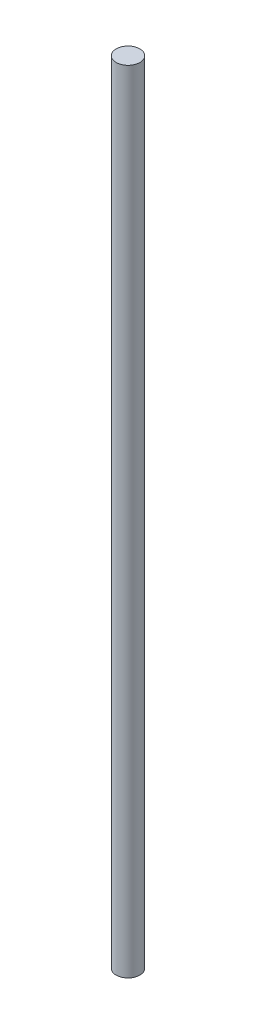
ISO-10303-21;
HEADER;
FILE_DESCRIPTION(('STEP AP214'),'2;1');
FILE_NAME('part.step','',(''),(''),'','','');
FILE_SCHEMA(('AUTOMOTIVE_DESIGN { 1 0 10303 214 1 1 1 1 }'));
ENDSEC;
DATA;
#1=APPLICATION_CONTEXT('core data for automotive mechanical design processes');
#2=APPLICATION_PROTOCOL_DEFINITION('international standard','automotive_design',2000,#1);
#3=PRODUCT_CONTEXT('',#1,'mechanical');
#4=PRODUCT('Part','Part','',(#3));
#5=PRODUCT_RELATED_PRODUCT_CATEGORY('part','',(#4));
#6=PRODUCT_DEFINITION_FORMATION('','',#4);
#7=PRODUCT_DEFINITION_CONTEXT('part definition',#1,'design');
#8=PRODUCT_DEFINITION('design','',#6,#7);
#9=PRODUCT_DEFINITION_SHAPE('','',#8);
#10=(LENGTH_UNIT() NAMED_UNIT(*) SI_UNIT(.MILLI.,.METRE.));
#11=(NAMED_UNIT(*) PLANE_ANGLE_UNIT() SI_UNIT($,.RADIAN.));
#12=(NAMED_UNIT(*) SI_UNIT($,.STERADIAN.) SOLID_ANGLE_UNIT());
#13=UNCERTAINTY_MEASURE_WITH_UNIT(LENGTH_MEASURE(1.E-05),#10,'distance_accuracy_value','');
#14=(GEOMETRIC_REPRESENTATION_CONTEXT(3) GLOBAL_UNCERTAINTY_ASSIGNED_CONTEXT((#13)) GLOBAL_UNIT_ASSIGNED_CONTEXT((#10,
#11,#12)) REPRESENTATION_CONTEXT('',''));
#15=CARTESIAN_POINT('',(0.,0.,0.));
#16=DIRECTION('',(0.,0.,1.));
#17=DIRECTION('',(1.,0.,0.));
#18=AXIS2_PLACEMENT_3D('',#15,#16,#17);
#19=CARTESIAN_POINT('',(0.,100.1,0.));
#20=DIRECTION('',(0.,-1.,0.));
#21=DIRECTION('',(0.,0.,-1.));
#22=AXIS2_PLACEMENT_3D('',#19,#20,#21);
#23=CYLINDRICAL_SURFACE('',#22,1.5);
#24=CARTESIAN_POINT('',(0.,100.1,0.));
#25=DIRECTION('',(0.,1.,0.));
#26=DIRECTION('',(0.,0.,1.));
#27=AXIS2_PLACEMENT_3D('',#24,#25,#26);
#28=CIRCLE('',#27,1.5);
#29=CARTESIAN_POINT('',(0.,100.1,1.5));
#30=VERTEX_POINT('',#29);
#31=EDGE_CURVE('E10',#30,#30,#28,.T.);
#32=ORIENTED_EDGE('',*,*,#31,.F.);
#33=EDGE_LOOP('',(#32));
#34=FACE_BOUND('',#33,.T.);
#35=CARTESIAN_POINT('',(0.,0.,0.));
#36=DIRECTION('',(0.,1.,0.));
#37=DIRECTION('',(0.,0.,1.));
#38=AXIS2_PLACEMENT_3D('',#35,#36,#37);
#39=CIRCLE('',#38,1.5);
#40=CARTESIAN_POINT('',(0.,0.,1.5));
#41=VERTEX_POINT('',#40);
#42=EDGE_CURVE('E34',#41,#41,#39,.T.);
#43=ORIENTED_EDGE('',*,*,#42,.T.);
#44=EDGE_LOOP('',(#43));
#45=FACE_BOUND('',#44,.T.);
#46=ADVANCED_FACE('F31',(#34,#45),#23,.T.);
#47=CARTESIAN_POINT('',(0.,100.1,0.));
#48=DIRECTION('',(0.,1.,0.));
#49=DIRECTION('',(0.,0.,1.));
#50=AXIS2_PLACEMENT_3D('',#47,#48,#49);
#51=PLANE('',#50);
#52=ORIENTED_EDGE('',*,*,#31,.T.);
#53=EDGE_LOOP('',(#52));
#54=FACE_BOUND('',#53,.T.);
#55=ADVANCED_FACE('F46',(#54),#51,.T.);
#56=CARTESIAN_POINT('',(0.,0.,0.));
#57=DIRECTION('',(0.,1.,0.));
#58=DIRECTION('',(0.,0.,1.));
#59=AXIS2_PLACEMENT_3D('',#56,#57,#58);
#60=PLANE('',#59);
#61=ORIENTED_EDGE('',*,*,#42,.F.);
#62=EDGE_LOOP('',(#61));
#63=FACE_BOUND('',#62,.T.);
#64=ADVANCED_FACE('F44',(#63),#60,.F.);
#65=CLOSED_SHELL('',(#46,#55,#64));
#66=MANIFOLD_SOLID_BREP('B2',#65);
#67=ADVANCED_BREP_SHAPE_REPRESENTATION('',(#18,#66),#14);
#68=SHAPE_DEFINITION_REPRESENTATION(#9,#67);
ENDSEC;
END-ISO-10303-21;
